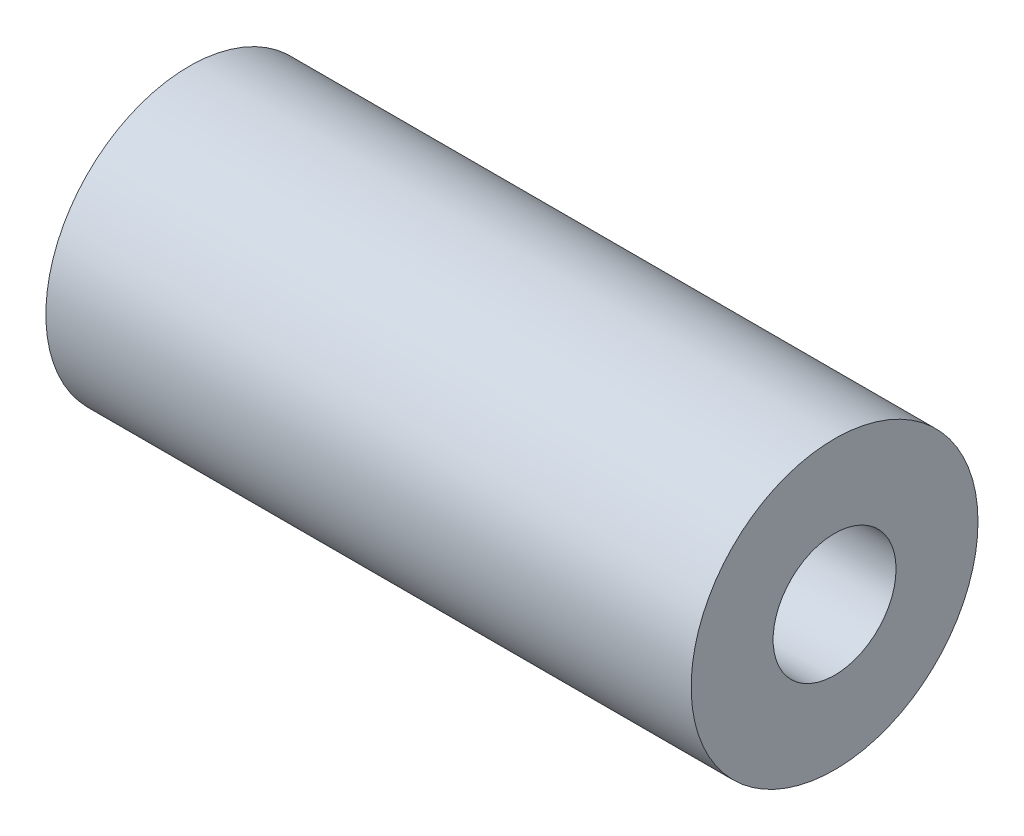
ISO-10303-21;
HEADER;
FILE_DESCRIPTION(('STEP AP214'),'2;1');
FILE_NAME('part.step','',(''),(''),'','','');
FILE_SCHEMA(('AUTOMOTIVE_DESIGN { 1 0 10303 214 1 1 1 1 }'));
ENDSEC;
DATA;
#1=APPLICATION_CONTEXT('core data for automotive mechanical design processes');
#2=APPLICATION_PROTOCOL_DEFINITION('international standard','automotive_design',2000,#1);
#3=PRODUCT_CONTEXT('',#1,'mechanical');
#4=PRODUCT('Part','Part','',(#3));
#5=PRODUCT_RELATED_PRODUCT_CATEGORY('part','',(#4));
#6=PRODUCT_DEFINITION_FORMATION('','',#4);
#7=PRODUCT_DEFINITION_CONTEXT('part definition',#1,'design');
#8=PRODUCT_DEFINITION('design','',#6,#7);
#9=PRODUCT_DEFINITION_SHAPE('','',#8);
#10=(LENGTH_UNIT() NAMED_UNIT(*) SI_UNIT(.MILLI.,.METRE.));
#11=(NAMED_UNIT(*) PLANE_ANGLE_UNIT() SI_UNIT($,.RADIAN.));
#12=(NAMED_UNIT(*) SI_UNIT($,.STERADIAN.) SOLID_ANGLE_UNIT());
#13=UNCERTAINTY_MEASURE_WITH_UNIT(LENGTH_MEASURE(1.E-05),#10,'distance_accuracy_value','');
#14=(GEOMETRIC_REPRESENTATION_CONTEXT(3) GLOBAL_UNCERTAINTY_ASSIGNED_CONTEXT((#13)) GLOBAL_UNIT_ASSIGNED_CONTEXT((#10,
#11,#12)) REPRESENTATION_CONTEXT('',''));
#15=CARTESIAN_POINT('',(0.,0.,0.));
#16=DIRECTION('',(0.,0.,1.));
#17=DIRECTION('',(1.,0.,0.));
#18=AXIS2_PLACEMENT_3D('',#15,#16,#17);
#19=CARTESIAN_POINT('',(25.,0.,0.));
#20=DIRECTION('',(1.,0.,0.));
#21=DIRECTION('',(0.,0.,-1.));
#22=AXIS2_PLACEMENT_3D('',#19,#20,#21);
#23=PLANE('',#22);
#24=CARTESIAN_POINT('',(25.,0.,0.));
#25=DIRECTION('',(1.,0.,0.));
#26=DIRECTION('',(0.,0.,-1.));
#27=AXIS2_PLACEMENT_3D('',#24,#25,#26);
#28=CIRCLE('',#27,11.1125);
#29=CARTESIAN_POINT('',(25.,0.,-11.1125));
#30=VERTEX_POINT('',#29);
#31=EDGE_CURVE('E10',#30,#30,#28,.T.);
#32=ORIENTED_EDGE('',*,*,#31,.T.);
#33=EDGE_LOOP('',(#32));
#34=FACE_BOUND('',#33,.T.);
#35=CARTESIAN_POINT('',(25.,0.,0.));
#36=DIRECTION('',(1.,0.,0.));
#37=DIRECTION('',(0.,0.,-1.));
#38=AXIS2_PLACEMENT_3D('',#35,#36,#37);
#39=CIRCLE('',#38,4.7625);
#40=CARTESIAN_POINT('',(25.,0.,-4.7625));
#41=VERTEX_POINT('',#40);
#42=EDGE_CURVE('E50',#41,#41,#39,.T.);
#43=ORIENTED_EDGE('',*,*,#42,.F.);
#44=EDGE_LOOP('',(#43));
#45=FACE_BOUND('',#44,.T.);
#46=ADVANCED_FACE('F37',(#34,#45),#23,.T.);
#47=CARTESIAN_POINT('',(-25.,0.,0.));
#48=DIRECTION('',(1.,0.,0.));
#49=DIRECTION('',(0.,0.,-1.));
#50=AXIS2_PLACEMENT_3D('',#47,#48,#49);
#51=PLANE('',#50);
#52=CARTESIAN_POINT('',(-25.,0.,0.));
#53=DIRECTION('',(1.,0.,0.));
#54=DIRECTION('',(0.,0.,-1.));
#55=AXIS2_PLACEMENT_3D('',#52,#53,#54);
#56=CIRCLE('',#55,11.1125);
#57=CARTESIAN_POINT('',(-25.,0.,-11.1125));
#58=VERTEX_POINT('',#57);
#59=EDGE_CURVE('E41',#58,#58,#56,.T.);
#60=ORIENTED_EDGE('',*,*,#59,.F.);
#61=EDGE_LOOP('',(#60));
#62=FACE_BOUND('',#61,.T.);
#63=CARTESIAN_POINT('',(-25.,0.,0.));
#64=DIRECTION('',(1.,0.,0.));
#65=DIRECTION('',(0.,0.,-1.));
#66=AXIS2_PLACEMENT_3D('',#63,#64,#65);
#67=CIRCLE('',#66,4.7625);
#68=CARTESIAN_POINT('',(-25.,0.,-4.7625));
#69=VERTEX_POINT('',#68);
#70=EDGE_CURVE('E52',#69,#69,#67,.T.);
#71=ORIENTED_EDGE('',*,*,#70,.T.);
#72=EDGE_LOOP('',(#71));
#73=FACE_BOUND('',#72,.T.);
#74=ADVANCED_FACE('F64',(#62,#73),#51,.F.);
#75=CARTESIAN_POINT('',(25.,0.,0.));
#76=DIRECTION('',(-1.,0.,0.));
#77=DIRECTION('',(0.,0.,1.));
#78=AXIS2_PLACEMENT_3D('',#75,#76,#77);
#79=CYLINDRICAL_SURFACE('',#78,11.1125);
#80=ORIENTED_EDGE('',*,*,#31,.F.);
#81=EDGE_LOOP('',(#80));
#82=FACE_BOUND('',#81,.T.);
#83=ORIENTED_EDGE('',*,*,#59,.T.);
#84=EDGE_LOOP('',(#83));
#85=FACE_BOUND('',#84,.T.);
#86=ADVANCED_FACE('F39',(#82,#85),#79,.T.);
#87=CARTESIAN_POINT('',(25.,0.,0.));
#88=DIRECTION('',(-1.,0.,0.));
#89=DIRECTION('',(0.,0.,1.));
#90=AXIS2_PLACEMENT_3D('',#87,#88,#89);
#91=CYLINDRICAL_SURFACE('',#90,4.7625);
#92=ORIENTED_EDGE('',*,*,#42,.T.);
#93=EDGE_LOOP('',(#92));
#94=FACE_BOUND('',#93,.T.);
#95=ORIENTED_EDGE('',*,*,#70,.F.);
#96=EDGE_LOOP('',(#95));
#97=FACE_BOUND('',#96,.T.);
#98=ADVANCED_FACE('F60',(#94,#97),#91,.F.);
#99=CLOSED_SHELL('',(#46,#74,#86,#98));
#100=MANIFOLD_SOLID_BREP('B2',#99);
#101=ADVANCED_BREP_SHAPE_REPRESENTATION('',(#18,#100),#14);
#102=SHAPE_DEFINITION_REPRESENTATION(#9,#101);
ENDSEC;
END-ISO-10303-21;
